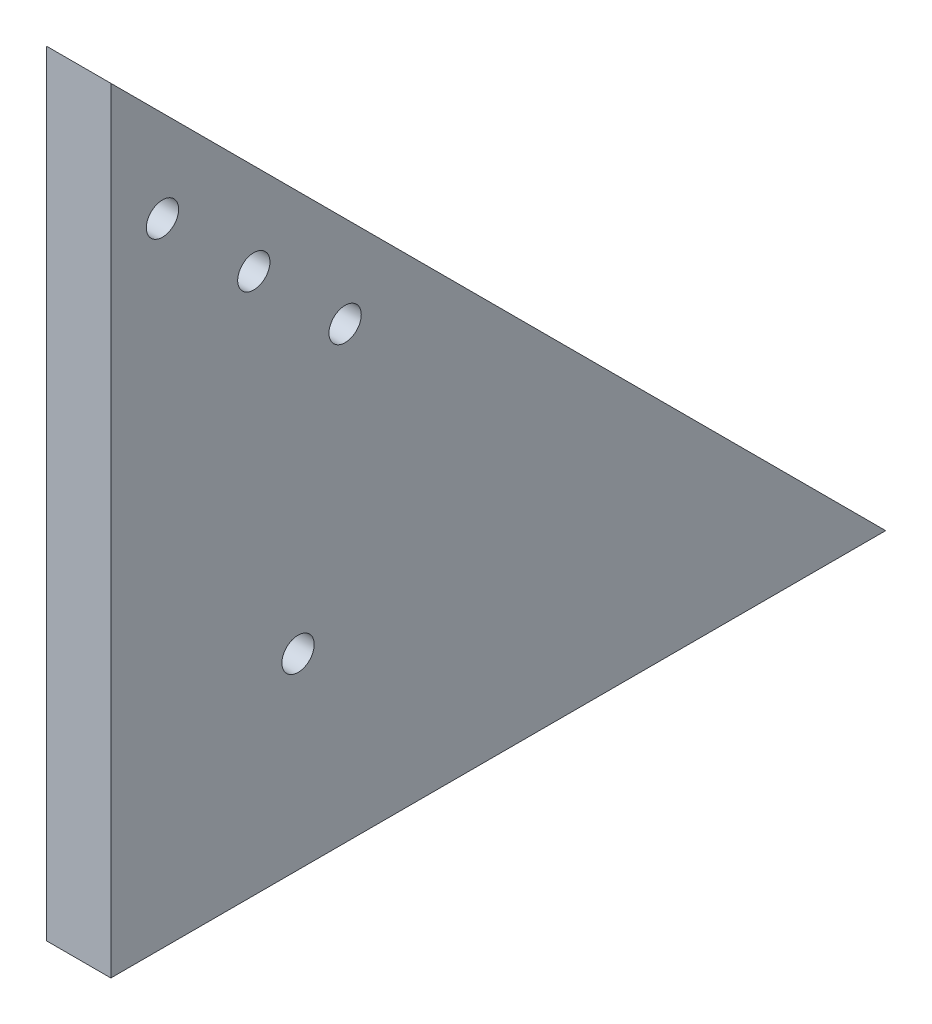
ISO-10303-21;
HEADER;
FILE_DESCRIPTION(('STEP AP214'),'2;1');
FILE_NAME('part.step','',(''),(''),'','','');
FILE_SCHEMA(('AUTOMOTIVE_DESIGN { 1 0 10303 214 1 1 1 1 }'));
ENDSEC;
DATA;
#1=APPLICATION_CONTEXT('core data for automotive mechanical design processes');
#2=APPLICATION_PROTOCOL_DEFINITION('international standard','automotive_design',2000,#1);
#3=PRODUCT_CONTEXT('',#1,'mechanical');
#4=PRODUCT('Part','Part','',(#3));
#5=PRODUCT_RELATED_PRODUCT_CATEGORY('part','',(#4));
#6=PRODUCT_DEFINITION_FORMATION('','',#4);
#7=PRODUCT_DEFINITION_CONTEXT('part definition',#1,'design');
#8=PRODUCT_DEFINITION('design','',#6,#7);
#9=PRODUCT_DEFINITION_SHAPE('','',#8);
#10=(LENGTH_UNIT() NAMED_UNIT(*) SI_UNIT(.MILLI.,.METRE.));
#11=(NAMED_UNIT(*) PLANE_ANGLE_UNIT() SI_UNIT($,.RADIAN.));
#12=(NAMED_UNIT(*) SI_UNIT($,.STERADIAN.) SOLID_ANGLE_UNIT());
#13=UNCERTAINTY_MEASURE_WITH_UNIT(LENGTH_MEASURE(1.E-05),#10,'distance_accuracy_value','');
#14=(GEOMETRIC_REPRESENTATION_CONTEXT(3) GLOBAL_UNCERTAINTY_ASSIGNED_CONTEXT((#13)) GLOBAL_UNIT_ASSIGNED_CONTEXT((#10,
#11,#12)) REPRESENTATION_CONTEXT('',''));
#15=CARTESIAN_POINT('',(0.,0.,0.));
#16=DIRECTION('',(0.,0.,1.));
#17=DIRECTION('',(1.,0.,0.));
#18=AXIS2_PLACEMENT_3D('',#15,#16,#17);
#19=CARTESIAN_POINT('',(10.,0.,0.));
#20=DIRECTION('',(0.,1.,0.));
#21=DIRECTION('',(0.,0.,1.));
#22=AXIS2_PLACEMENT_3D('',#19,#20,#21);
#23=PLANE('',#22);
#24=DIRECTION('',(0.,0.,-1.));
#25=VECTOR('',#24,1.);
#26=CARTESIAN_POINT('',(0.,0.,0.));
#27=LINE('',#26,#25);
#28=CARTESIAN_POINT('',(0.,0.,0.));
#29=VERTEX_POINT('',#28);
#30=CARTESIAN_POINT('',(0.,0.,-120.));
#31=VERTEX_POINT('',#30);
#32=EDGE_CURVE('E84',#29,#31,#27,.T.);
#33=ORIENTED_EDGE('',*,*,#32,.T.);
#34=DIRECTION('',(-1.,0.,0.));
#35=VECTOR('',#34,1.);
#36=CARTESIAN_POINT('',(10.,0.,-120.));
#37=LINE('',#36,#35);
#38=CARTESIAN_POINT('',(10.,0.,-120.));
#39=VERTEX_POINT('',#38);
#40=EDGE_CURVE('E11',#39,#31,#37,.T.);
#41=ORIENTED_EDGE('',*,*,#40,.F.);
#42=DIRECTION('',(0.,0.,-1.));
#43=VECTOR('',#42,1.);
#44=CARTESIAN_POINT('',(10.,0.,0.));
#45=LINE('',#44,#43);
#46=CARTESIAN_POINT('',(10.,0.,0.));
#47=VERTEX_POINT('',#46);
#48=EDGE_CURVE('E77',#47,#39,#45,.T.);
#49=ORIENTED_EDGE('',*,*,#48,.F.);
#50=DIRECTION('',(-1.,0.,0.));
#51=VECTOR('',#50,1.);
#52=CARTESIAN_POINT('',(10.,0.,0.));
#53=LINE('',#52,#51);
#54=EDGE_CURVE('E85',#47,#29,#53,.T.);
#55=ORIENTED_EDGE('',*,*,#54,.T.);
#56=EDGE_LOOP('',(#33,#41,#49,#55));
#57=FACE_BOUND('',#56,.T.);
#58=ADVANCED_FACE('F37',(#57),#23,.F.);
#59=CARTESIAN_POINT('',(10.,0.,-120.));
#60=DIRECTION('',(0.,-0.707106781186548,0.707106781186548));
#61=DIRECTION('',(0.,-0.707106781186548,-0.707106781186548));
#62=AXIS2_PLACEMENT_3D('',#59,#60,#61);
#63=PLANE('',#62);
#64=DIRECTION('',(0.,0.707106781186547,0.707106781186547));
#65=VECTOR('',#64,1.);
#66=CARTESIAN_POINT('',(0.,0.,-120.));
#67=LINE('',#66,#65);
#68=CARTESIAN_POINT('',(0.,120.,0.));
#69=VERTEX_POINT('',#68);
#70=EDGE_CURVE('E65',#31,#69,#67,.T.);
#71=ORIENTED_EDGE('',*,*,#70,.T.);
#72=DIRECTION('',(-1.,0.,0.));
#73=VECTOR('',#72,1.);
#74=CARTESIAN_POINT('',(10.,120.,0.));
#75=LINE('',#74,#73);
#76=CARTESIAN_POINT('',(10.,120.,0.));
#77=VERTEX_POINT('',#76);
#78=EDGE_CURVE('E45',#77,#69,#75,.T.);
#79=ORIENTED_EDGE('',*,*,#78,.F.);
#80=DIRECTION('',(0.,0.707106781186547,0.707106781186547));
#81=VECTOR('',#80,1.);
#82=CARTESIAN_POINT('',(10.,0.,-120.));
#83=LINE('',#82,#81);
#84=EDGE_CURVE('E73',#39,#77,#83,.T.);
#85=ORIENTED_EDGE('',*,*,#84,.F.);
#86=ORIENTED_EDGE('',*,*,#40,.T.);
#87=EDGE_LOOP('',(#71,#79,#85,#86));
#88=FACE_BOUND('',#87,.T.);
#89=ADVANCED_FACE('F74',(#88),#63,.F.);
#90=CARTESIAN_POINT('',(10.,0.,0.));
#91=DIRECTION('',(0.,0.,-1.));
#92=DIRECTION('',(-1.,0.,0.));
#93=AXIS2_PLACEMENT_3D('',#90,#91,#92);
#94=PLANE('',#93);
#95=DIRECTION('',(0.,-1.,0.));
#96=VECTOR('',#95,1.);
#97=CARTESIAN_POINT('',(0.,0.,0.));
#98=LINE('',#97,#96);
#99=EDGE_CURVE('E70',#69,#29,#98,.T.);
#100=ORIENTED_EDGE('',*,*,#99,.T.);
#101=ORIENTED_EDGE('',*,*,#54,.F.);
#102=DIRECTION('',(0.,-1.,0.));
#103=VECTOR('',#102,1.);
#104=CARTESIAN_POINT('',(10.,0.,0.));
#105=LINE('',#104,#103);
#106=EDGE_CURVE('E53',#77,#47,#105,.T.);
#107=ORIENTED_EDGE('',*,*,#106,.F.);
#108=ORIENTED_EDGE('',*,*,#78,.T.);
#109=EDGE_LOOP('',(#100,#101,#107,#108));
#110=FACE_BOUND('',#109,.T.);
#111=ADVANCED_FACE('F96',(#110),#94,.F.);
#112=CARTESIAN_POINT('',(10.,0.,0.));
#113=DIRECTION('',(1.,0.,0.));
#114=DIRECTION('',(0.,0.,-1.));
#115=AXIS2_PLACEMENT_3D('',#112,#113,#114);
#116=PLANE('',#115);
#117=CARTESIAN_POINT('',(10.,28.9913780286484,-28.9913780286484));
#118=DIRECTION('',(1.,0.,0.));
#119=DIRECTION('',(0.,0.,-1.));
#120=AXIS2_PLACEMENT_3D('',#117,#118,#119);
#121=CIRCLE('',#120,2.5);
#122=CARTESIAN_POINT('',(10.,28.9913780286484,-31.4913780286484));
#123=VERTEX_POINT('',#122);
#124=EDGE_CURVE('E175',#123,#123,#121,.T.);
#125=ORIENTED_EDGE('',*,*,#124,.F.);
#126=EDGE_LOOP('',(#125));
#127=FACE_BOUND('',#126,.T.);
#128=CARTESIAN_POINT('',(10.,97.8627641979957,-7.99510017827339));
#129=DIRECTION('',(1.,0.,0.));
#130=DIRECTION('',(0.,0.,-1.));
#131=AXIS2_PLACEMENT_3D('',#128,#129,#130);
#132=CIRCLE('',#131,2.5);
#133=CARTESIAN_POINT('',(10.,97.8627641979957,-10.4951001782734));
#134=VERTEX_POINT('',#133);
#135=EDGE_CURVE('E177',#134,#134,#132,.T.);
#136=ORIENTED_EDGE('',*,*,#135,.F.);
#137=EDGE_LOOP('',(#136));
#138=FACE_BOUND('',#137,.T.);
#139=CARTESIAN_POINT('',(10.,69.5784929505338,-36.2793714257353));
#140=DIRECTION('',(1.,0.,0.));
#141=DIRECTION('',(0.,0.,-1.));
#142=AXIS2_PLACEMENT_3D('',#139,#140,#141);
#143=CIRCLE('',#142,2.5);
#144=CARTESIAN_POINT('',(10.,69.5784929505338,-38.7793714257353));
#145=VERTEX_POINT('',#144);
#146=EDGE_CURVE('E186',#145,#145,#143,.T.);
#147=ORIENTED_EDGE('',*,*,#146,.F.);
#148=EDGE_LOOP('',(#147));
#149=FACE_BOUND('',#148,.T.);
#150=CARTESIAN_POINT('',(10.,83.7206285742647,-22.1372358020043));
#151=DIRECTION('',(1.,0.,0.));
#152=DIRECTION('',(0.,0.,-1.));
#153=AXIS2_PLACEMENT_3D('',#150,#151,#152);
#154=CIRCLE('',#153,2.5);
#155=CARTESIAN_POINT('',(10.,83.7206285742647,-24.6372358020043));
#156=VERTEX_POINT('',#155);
#157=EDGE_CURVE('E91',#156,#156,#154,.T.);
#158=ORIENTED_EDGE('',*,*,#157,.F.);
#159=EDGE_LOOP('',(#158));
#160=FACE_BOUND('',#159,.T.);
#161=ORIENTED_EDGE('',*,*,#48,.T.);
#162=ORIENTED_EDGE('',*,*,#84,.T.);
#163=ORIENTED_EDGE('',*,*,#106,.T.);
#164=EDGE_LOOP('',(#161,#162,#163));
#165=FACE_BOUND('',#164,.T.);
#166=ADVANCED_FACE('F80',(#127,#138,#149,#160,#165),#116,.T.);
#167=CARTESIAN_POINT('',(0.,0.,0.));
#168=DIRECTION('',(1.,0.,0.));
#169=DIRECTION('',(0.,0.,-1.));
#170=AXIS2_PLACEMENT_3D('',#167,#168,#169);
#171=PLANE('',#170);
#172=CARTESIAN_POINT('',(0.,28.9913780286484,-28.9913780286484));
#173=DIRECTION('',(1.,0.,0.));
#174=DIRECTION('',(0.,0.,-1.));
#175=AXIS2_PLACEMENT_3D('',#172,#173,#174);
#176=CIRCLE('',#175,2.5);
#177=CARTESIAN_POINT('',(0.,28.9913780286484,-31.4913780286484));
#178=VERTEX_POINT('',#177);
#179=EDGE_CURVE('E172',#178,#178,#176,.T.);
#180=ORIENTED_EDGE('',*,*,#179,.T.);
#181=EDGE_LOOP('',(#180));
#182=FACE_BOUND('',#181,.T.);
#183=CARTESIAN_POINT('',(0.,97.8627641979957,-7.99510017827339));
#184=DIRECTION('',(1.,0.,0.));
#185=DIRECTION('',(0.,0.,-1.));
#186=AXIS2_PLACEMENT_3D('',#183,#184,#185);
#187=CIRCLE('',#186,2.5);
#188=CARTESIAN_POINT('',(0.,97.8627641979957,-10.4951001782734));
#189=VERTEX_POINT('',#188);
#190=EDGE_CURVE('E191',#189,#189,#187,.T.);
#191=ORIENTED_EDGE('',*,*,#190,.T.);
#192=EDGE_LOOP('',(#191));
#193=FACE_BOUND('',#192,.T.);
#194=CARTESIAN_POINT('',(0.,69.5784929505338,-36.2793714257353));
#195=DIRECTION('',(1.,0.,0.));
#196=DIRECTION('',(0.,0.,-1.));
#197=AXIS2_PLACEMENT_3D('',#194,#195,#196);
#198=CIRCLE('',#197,2.5);
#199=CARTESIAN_POINT('',(0.,69.5784929505338,-38.7793714257353));
#200=VERTEX_POINT('',#199);
#201=EDGE_CURVE('E182',#200,#200,#198,.T.);
#202=ORIENTED_EDGE('',*,*,#201,.T.);
#203=EDGE_LOOP('',(#202));
#204=FACE_BOUND('',#203,.T.);
#205=CARTESIAN_POINT('',(0.,83.7206285742647,-22.1372358020043));
#206=DIRECTION('',(1.,0.,0.));
#207=DIRECTION('',(0.,0.,-1.));
#208=AXIS2_PLACEMENT_3D('',#205,#206,#207);
#209=CIRCLE('',#208,2.5);
#210=CARTESIAN_POINT('',(0.,83.7206285742647,-24.6372358020043));
#211=VERTEX_POINT('',#210);
#212=EDGE_CURVE('E87',#211,#211,#209,.T.);
#213=ORIENTED_EDGE('',*,*,#212,.T.);
#214=EDGE_LOOP('',(#213));
#215=FACE_BOUND('',#214,.T.);
#216=ORIENTED_EDGE('',*,*,#32,.F.);
#217=ORIENTED_EDGE('',*,*,#99,.F.);
#218=ORIENTED_EDGE('',*,*,#70,.F.);
#219=EDGE_LOOP('',(#216,#217,#218));
#220=FACE_BOUND('',#219,.T.);
#221=ADVANCED_FACE('F97',(#182,#193,#204,#215,#220),#171,.F.);
#222=CARTESIAN_POINT('',(0.,83.7206285742647,-22.1372358020043));
#223=DIRECTION('',(1.,0.,0.));
#224=DIRECTION('',(0.,0.,-1.));
#225=AXIS2_PLACEMENT_3D('',#222,#223,#224);
#226=CYLINDRICAL_SURFACE('',#225,2.5);
#227=ORIENTED_EDGE('',*,*,#212,.F.);
#228=EDGE_LOOP('',(#227));
#229=FACE_BOUND('',#228,.T.);
#230=ORIENTED_EDGE('',*,*,#157,.T.);
#231=EDGE_LOOP('',(#230));
#232=FACE_BOUND('',#231,.T.);
#233=ADVANCED_FACE('F99',(#229,#232),#226,.F.);
#234=CARTESIAN_POINT('',(0.,69.5784929505338,-36.2793714257353));
#235=DIRECTION('',(1.,0.,0.));
#236=DIRECTION('',(0.,0.,-1.));
#237=AXIS2_PLACEMENT_3D('',#234,#235,#236);
#238=CYLINDRICAL_SURFACE('',#237,2.5);
#239=ORIENTED_EDGE('',*,*,#201,.F.);
#240=EDGE_LOOP('',(#239));
#241=FACE_BOUND('',#240,.T.);
#242=ORIENTED_EDGE('',*,*,#146,.T.);
#243=EDGE_LOOP('',(#242));
#244=FACE_BOUND('',#243,.T.);
#245=ADVANCED_FACE('F106',(#241,#244),#238,.F.);
#246=CARTESIAN_POINT('',(0.,97.8627641979957,-7.99510017827339));
#247=DIRECTION('',(1.,0.,0.));
#248=DIRECTION('',(0.,0.,-1.));
#249=AXIS2_PLACEMENT_3D('',#246,#247,#248);
#250=CYLINDRICAL_SURFACE('',#249,2.5);
#251=ORIENTED_EDGE('',*,*,#190,.F.);
#252=EDGE_LOOP('',(#251));
#253=FACE_BOUND('',#252,.T.);
#254=ORIENTED_EDGE('',*,*,#135,.T.);
#255=EDGE_LOOP('',(#254));
#256=FACE_BOUND('',#255,.T.);
#257=ADVANCED_FACE('F146',(#253,#256),#250,.F.);
#258=CARTESIAN_POINT('',(0.,28.9913780286484,-28.9913780286484));
#259=DIRECTION('',(1.,0.,0.));
#260=DIRECTION('',(0.,0.,-1.));
#261=AXIS2_PLACEMENT_3D('',#258,#259,#260);
#262=CYLINDRICAL_SURFACE('',#261,2.5);
#263=ORIENTED_EDGE('',*,*,#179,.F.);
#264=EDGE_LOOP('',(#263));
#265=FACE_BOUND('',#264,.T.);
#266=ORIENTED_EDGE('',*,*,#124,.T.);
#267=EDGE_LOOP('',(#266));
#268=FACE_BOUND('',#267,.T.);
#269=ADVANCED_FACE('F156',(#265,#268),#262,.F.);
#270=CLOSED_SHELL('',(#58,#89,#111,#166,#221,#233,#245,#257,#269));
#271=MANIFOLD_SOLID_BREP('B2',#270);
#272=ADVANCED_BREP_SHAPE_REPRESENTATION('',(#18,#271),#14);
#273=SHAPE_DEFINITION_REPRESENTATION(#9,#272);
ENDSEC;
END-ISO-10303-21;
